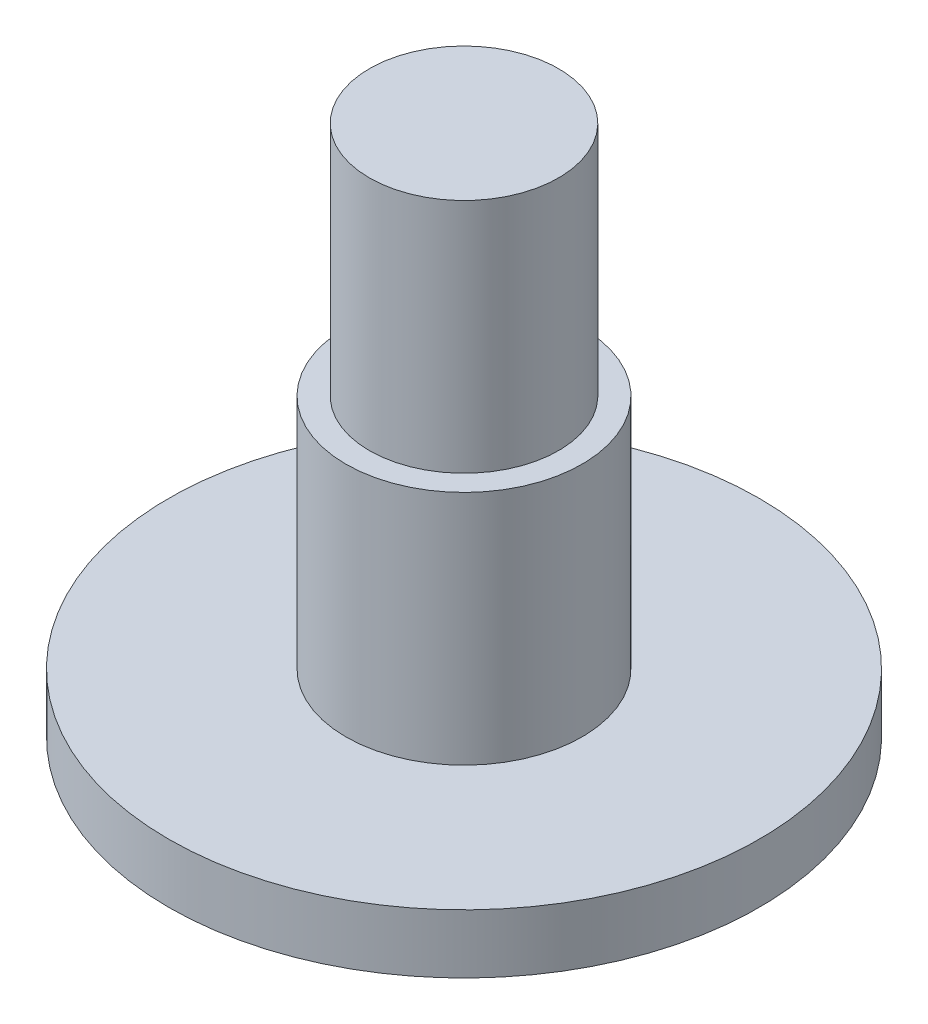
ISO-10303-21;
HEADER;
FILE_DESCRIPTION(('STEP AP214'),'2;1');
FILE_NAME('part.step','',(''),(''),'','','');
FILE_SCHEMA(('AUTOMOTIVE_DESIGN { 1 0 10303 214 1 1 1 1 }'));
ENDSEC;
DATA;
#1=APPLICATION_CONTEXT('core data for automotive mechanical design processes');
#2=APPLICATION_PROTOCOL_DEFINITION('international standard','automotive_design',2000,#1);
#3=PRODUCT_CONTEXT('',#1,'mechanical');
#4=PRODUCT('Part','Part','',(#3));
#5=PRODUCT_RELATED_PRODUCT_CATEGORY('part','',(#4));
#6=PRODUCT_DEFINITION_FORMATION('','',#4);
#7=PRODUCT_DEFINITION_CONTEXT('part definition',#1,'design');
#8=PRODUCT_DEFINITION('design','',#6,#7);
#9=PRODUCT_DEFINITION_SHAPE('','',#8);
#10=(LENGTH_UNIT() NAMED_UNIT(*) SI_UNIT(.MILLI.,.METRE.));
#11=(NAMED_UNIT(*) PLANE_ANGLE_UNIT() SI_UNIT($,.RADIAN.));
#12=(NAMED_UNIT(*) SI_UNIT($,.STERADIAN.) SOLID_ANGLE_UNIT());
#13=UNCERTAINTY_MEASURE_WITH_UNIT(LENGTH_MEASURE(1.E-05),#10,'distance_accuracy_value','');
#14=(GEOMETRIC_REPRESENTATION_CONTEXT(3) GLOBAL_UNCERTAINTY_ASSIGNED_CONTEXT((#13)) GLOBAL_UNIT_ASSIGNED_CONTEXT((#10,
#11,#12)) REPRESENTATION_CONTEXT('',''));
#15=CARTESIAN_POINT('',(0.,0.,0.));
#16=DIRECTION('',(0.,0.,1.));
#17=DIRECTION('',(1.,0.,0.));
#18=AXIS2_PLACEMENT_3D('',#15,#16,#17);
#19=CARTESIAN_POINT('',(0.,1.,0.));
#20=DIRECTION('',(0.,-1.,0.));
#21=DIRECTION('',(0.,0.,-1.));
#22=AXIS2_PLACEMENT_3D('',#19,#20,#21);
#23=CYLINDRICAL_SURFACE('',#22,5.);
#24=CARTESIAN_POINT('',(0.,1.,0.));
#25=DIRECTION('',(0.,1.,0.));
#26=DIRECTION('',(0.,0.,1.));
#27=AXIS2_PLACEMENT_3D('',#24,#25,#26);
#28=CIRCLE('',#27,5.);
#29=CARTESIAN_POINT('',(0.,1.,5.));
#30=VERTEX_POINT('',#29);
#31=EDGE_CURVE('E51',#30,#30,#28,.T.);
#32=ORIENTED_EDGE('',*,*,#31,.F.);
#33=EDGE_LOOP('',(#32));
#34=FACE_BOUND('',#33,.T.);
#35=CARTESIAN_POINT('',(0.,0.,0.));
#36=DIRECTION('',(0.,1.,0.));
#37=DIRECTION('',(0.,0.,1.));
#38=AXIS2_PLACEMENT_3D('',#35,#36,#37);
#39=CIRCLE('',#38,5.);
#40=CARTESIAN_POINT('',(0.,0.,5.));
#41=VERTEX_POINT('',#40);
#42=EDGE_CURVE('E40',#41,#41,#39,.T.);
#43=ORIENTED_EDGE('',*,*,#42,.T.);
#44=EDGE_LOOP('',(#43));
#45=FACE_BOUND('',#44,.T.);
#46=ADVANCED_FACE('F37',(#34,#45),#23,.T.);
#47=CARTESIAN_POINT('',(0.,1.,0.));
#48=DIRECTION('',(0.,1.,0.));
#49=DIRECTION('',(0.,0.,1.));
#50=AXIS2_PLACEMENT_3D('',#47,#48,#49);
#51=PLANE('',#50);
#52=CARTESIAN_POINT('',(0.,1.,0.));
#53=DIRECTION('',(0.,1.,0.));
#54=DIRECTION('',(0.,0.,1.));
#55=AXIS2_PLACEMENT_3D('',#52,#53,#54);
#56=CIRCLE('',#55,2.);
#57=CARTESIAN_POINT('',(0.,1.,2.));
#58=VERTEX_POINT('',#57);
#59=EDGE_CURVE('E45',#58,#58,#56,.T.);
#60=ORIENTED_EDGE('',*,*,#59,.F.);
#61=EDGE_LOOP('',(#60));
#62=FACE_BOUND('',#61,.T.);
#63=ORIENTED_EDGE('',*,*,#31,.T.);
#64=EDGE_LOOP('',(#63));
#65=FACE_BOUND('',#64,.T.);
#66=ADVANCED_FACE('F71',(#62,#65),#51,.T.);
#67=CARTESIAN_POINT('',(0.,0.,0.));
#68=DIRECTION('',(0.,1.,0.));
#69=DIRECTION('',(0.,0.,1.));
#70=AXIS2_PLACEMENT_3D('',#67,#68,#69);
#71=PLANE('',#70);
#72=ORIENTED_EDGE('',*,*,#42,.F.);
#73=EDGE_LOOP('',(#72));
#74=FACE_BOUND('',#73,.T.);
#75=ADVANCED_FACE('F68',(#74),#71,.F.);
#76=CARTESIAN_POINT('',(0.,5.,0.));
#77=DIRECTION('',(0.,-1.,0.));
#78=DIRECTION('',(0.,0.,-1.));
#79=AXIS2_PLACEMENT_3D('',#76,#77,#78);
#80=CYLINDRICAL_SURFACE('',#79,2.);
#81=CARTESIAN_POINT('',(0.,5.,0.));
#82=DIRECTION('',(0.,1.,0.));
#83=DIRECTION('',(0.,0.,1.));
#84=AXIS2_PLACEMENT_3D('',#81,#82,#83);
#85=CIRCLE('',#84,2.);
#86=CARTESIAN_POINT('',(0.,5.,2.));
#87=VERTEX_POINT('',#86);
#88=EDGE_CURVE('E56',#87,#87,#85,.T.);
#89=ORIENTED_EDGE('',*,*,#88,.F.);
#90=EDGE_LOOP('',(#89));
#91=FACE_BOUND('',#90,.T.);
#92=ORIENTED_EDGE('',*,*,#59,.T.);
#93=EDGE_LOOP('',(#92));
#94=FACE_BOUND('',#93,.T.);
#95=ADVANCED_FACE('F70',(#91,#94),#80,.T.);
#96=CARTESIAN_POINT('',(0.,5.,0.));
#97=DIRECTION('',(0.,1.,0.));
#98=DIRECTION('',(0.,0.,1.));
#99=AXIS2_PLACEMENT_3D('',#96,#97,#98);
#100=PLANE('',#99);
#101=CARTESIAN_POINT('',(0.,5.,0.));
#102=DIRECTION('',(0.,1.,0.));
#103=DIRECTION('',(0.,0.,1.));
#104=AXIS2_PLACEMENT_3D('',#101,#102,#103);
#105=CIRCLE('',#104,1.6025);
#106=CARTESIAN_POINT('',(0.,5.,1.6025));
#107=VERTEX_POINT('',#106);
#108=EDGE_CURVE('E10',#107,#107,#105,.T.);
#109=ORIENTED_EDGE('',*,*,#108,.F.);
#110=EDGE_LOOP('',(#109));
#111=FACE_BOUND('',#110,.T.);
#112=ORIENTED_EDGE('',*,*,#88,.T.);
#113=EDGE_LOOP('',(#112));
#114=FACE_BOUND('',#113,.T.);
#115=ADVANCED_FACE('F76',(#111,#114),#100,.T.);
#116=CARTESIAN_POINT('',(0.,9.,0.));
#117=DIRECTION('',(0.,-1.,0.));
#118=DIRECTION('',(0.,0.,-1.));
#119=AXIS2_PLACEMENT_3D('',#116,#117,#118);
#120=CYLINDRICAL_SURFACE('',#119,1.6025);
#121=CARTESIAN_POINT('',(0.,9.,0.));
#122=DIRECTION('',(0.,1.,0.));
#123=DIRECTION('',(0.,0.,1.));
#124=AXIS2_PLACEMENT_3D('',#121,#122,#123);
#125=CIRCLE('',#124,1.6025);
#126=CARTESIAN_POINT('',(0.,9.,1.6025));
#127=VERTEX_POINT('',#126);
#128=EDGE_CURVE('E55',#127,#127,#125,.T.);
#129=ORIENTED_EDGE('',*,*,#128,.F.);
#130=EDGE_LOOP('',(#129));
#131=FACE_BOUND('',#130,.T.);
#132=ORIENTED_EDGE('',*,*,#108,.T.);
#133=EDGE_LOOP('',(#132));
#134=FACE_BOUND('',#133,.T.);
#135=ADVANCED_FACE('F106',(#131,#134),#120,.T.);
#136=CARTESIAN_POINT('',(0.,9.,0.));
#137=DIRECTION('',(0.,1.,0.));
#138=DIRECTION('',(0.,0.,1.));
#139=AXIS2_PLACEMENT_3D('',#136,#137,#138);
#140=PLANE('',#139);
#141=ORIENTED_EDGE('',*,*,#128,.T.);
#142=EDGE_LOOP('',(#141));
#143=FACE_BOUND('',#142,.T.);
#144=ADVANCED_FACE('F116',(#143),#140,.T.);
#145=CLOSED_SHELL('',(#46,#66,#75,#95,#115,#135,#144));
#146=MANIFOLD_SOLID_BREP('B2',#145);
#147=ADVANCED_BREP_SHAPE_REPRESENTATION('',(#18,#146),#14);
#148=SHAPE_DEFINITION_REPRESENTATION(#9,#147);
ENDSEC;
END-ISO-10303-21;
